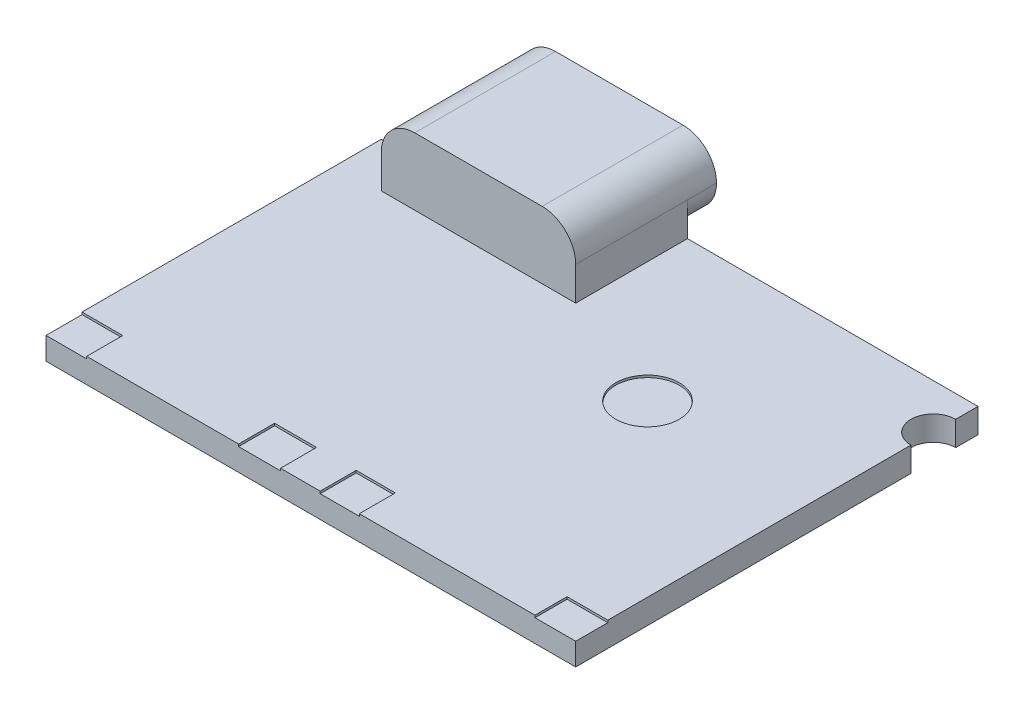
ISO-10303-21;
HEADER;
FILE_DESCRIPTION(('STEP AP214'),'2;1');
FILE_NAME('part.step','',(''),(''),'','','');
FILE_SCHEMA(('AUTOMOTIVE_DESIGN { 1 0 10303 214 1 1 1 1 }'));
ENDSEC;
DATA;
#1=APPLICATION_CONTEXT('core data for automotive mechanical design processes');
#2=APPLICATION_PROTOCOL_DEFINITION('international standard','automotive_design',2000,#1);
#3=PRODUCT_CONTEXT('',#1,'mechanical');
#4=PRODUCT('Part','Part','',(#3));
#5=PRODUCT_RELATED_PRODUCT_CATEGORY('part','',(#4));
#6=PRODUCT_DEFINITION_FORMATION('','',#4);
#7=PRODUCT_DEFINITION_CONTEXT('part definition',#1,'design');
#8=PRODUCT_DEFINITION('design','',#6,#7);
#9=PRODUCT_DEFINITION_SHAPE('','',#8);
#10=(LENGTH_UNIT() NAMED_UNIT(*) SI_UNIT(.MILLI.,.METRE.));
#11=(NAMED_UNIT(*) PLANE_ANGLE_UNIT() SI_UNIT($,.RADIAN.));
#12=(NAMED_UNIT(*) SI_UNIT($,.STERADIAN.) SOLID_ANGLE_UNIT());
#13=UNCERTAINTY_MEASURE_WITH_UNIT(LENGTH_MEASURE(1.E-05),#10,'distance_accuracy_value','');
#14=(GEOMETRIC_REPRESENTATION_CONTEXT(3) GLOBAL_UNCERTAINTY_ASSIGNED_CONTEXT((#13)) GLOBAL_UNIT_ASSIGNED_CONTEXT((#10,
#11,#12)) REPRESENTATION_CONTEXT('',''));
#15=CARTESIAN_POINT('',(0.,0.,0.));
#16=DIRECTION('',(0.,0.,1.));
#17=DIRECTION('',(1.,0.,0.));
#18=AXIS2_PLACEMENT_3D('',#15,#16,#17);
#19=CARTESIAN_POINT('',(0.,1.1,0.));
#20=DIRECTION('',(1.,0.,0.));
#21=DIRECTION('',(0.,0.,-1.));
#22=AXIS2_PLACEMENT_3D('',#19,#20,#21);
#23=PLANE('',#22);
#24=DIRECTION('',(0.,0.,1.));
#25=VECTOR('',#24,1.);
#26=CARTESIAN_POINT('',(0.,0.,0.));
#27=LINE('',#26,#25);
#28=CARTESIAN_POINT('',(0.,0.,-18.));
#29=VERTEX_POINT('',#28);
#30=CARTESIAN_POINT('',(0.,0.,-17.));
#31=VERTEX_POINT('',#30);
#32=EDGE_CURVE('E266',#29,#31,#27,.T.);
#33=ORIENTED_EDGE('',*,*,#32,.T.);
#34=DIRECTION('',(0.,1.,0.));
#35=VECTOR('',#34,1.);
#36=CARTESIAN_POINT('',(0.,0.,-17.));
#37=LINE('',#36,#35);
#38=CARTESIAN_POINT('',(0.,1.1,-17.));
#39=VERTEX_POINT('',#38);
#40=EDGE_CURVE('E64',#31,#39,#37,.T.);
#41=ORIENTED_EDGE('',*,*,#40,.T.);
#42=DIRECTION('',(0.,0.,1.));
#43=VECTOR('',#42,1.);
#44=CARTESIAN_POINT('',(0.,1.1,0.));
#45=LINE('',#44,#43);
#46=CARTESIAN_POINT('',(0.,1.1,-18.));
#47=VERTEX_POINT('',#46);
#48=EDGE_CURVE('E463',#47,#39,#45,.T.);
#49=ORIENTED_EDGE('',*,*,#48,.F.);
#50=DIRECTION('',(0.,-1.,0.));
#51=VECTOR('',#50,1.);
#52=CARTESIAN_POINT('',(0.,1.1,-18.));
#53=LINE('',#52,#51);
#54=EDGE_CURVE('E272',#47,#29,#53,.T.);
#55=ORIENTED_EDGE('',*,*,#54,.T.);
#56=EDGE_LOOP('',(#33,#41,#49,#55));
#57=FACE_BOUND('',#56,.T.);
#58=ADVANCED_FACE('F42',(#57),#23,.F.);
#59=CARTESIAN_POINT('',(23.7,1.1,0.));
#60=DIRECTION('',(-1.,0.,0.));
#61=DIRECTION('',(0.,0.,1.));
#62=AXIS2_PLACEMENT_3D('',#59,#60,#61);
#63=PLANE('',#62);
#64=DIRECTION('',(0.,0.,-1.));
#65=VECTOR('',#64,1.);
#66=CARTESIAN_POINT('',(23.7,0.,0.));
#67=LINE('',#66,#65);
#68=CARTESIAN_POINT('',(23.7,0.,0.));
#69=VERTEX_POINT('',#68);
#70=CARTESIAN_POINT('',(23.7,0.,-15.));
#71=VERTEX_POINT('',#70);
#72=EDGE_CURVE('E262',#69,#71,#67,.T.);
#73=ORIENTED_EDGE('',*,*,#72,.T.);
#74=DIRECTION('',(0.,1.,0.));
#75=VECTOR('',#74,1.);
#76=CARTESIAN_POINT('',(23.7,0.,-15.));
#77=LINE('',#76,#75);
#78=CARTESIAN_POINT('',(23.7,1.1,-15.));
#79=VERTEX_POINT('',#78);
#80=EDGE_CURVE('E56',#71,#79,#77,.T.);
#81=ORIENTED_EDGE('',*,*,#80,.T.);
#82=DIRECTION('',(0.,0.,-1.));
#83=VECTOR('',#82,1.);
#84=CARTESIAN_POINT('',(23.7,1.1,0.));
#85=LINE('',#84,#83);
#86=CARTESIAN_POINT('',(23.7,1.1,-1.43434090909091));
#87=VERTEX_POINT('',#86);
#88=EDGE_CURVE('E471',#87,#79,#85,.T.);
#89=ORIENTED_EDGE('',*,*,#88,.F.);
#90=DIRECTION('',(0.,1.,0.));
#91=VECTOR('',#90,1.);
#92=CARTESIAN_POINT('',(23.7,1.,-1.43434090909091));
#93=LINE('',#92,#91);
#94=CARTESIAN_POINT('',(23.7,1.,-1.43434090909091));
#95=VERTEX_POINT('',#94);
#96=EDGE_CURVE('E425',#95,#87,#93,.T.);
#97=ORIENTED_EDGE('',*,*,#96,.F.);
#98=DIRECTION('',(0.,0.,-1.));
#99=VECTOR('',#98,1.);
#100=CARTESIAN_POINT('',(23.7,1.,0.));
#101=LINE('',#100,#99);
#102=CARTESIAN_POINT('',(23.7,1.,0.));
#103=VERTEX_POINT('',#102);
#104=EDGE_CURVE('E421',#103,#95,#101,.T.);
#105=ORIENTED_EDGE('',*,*,#104,.F.);
#106=DIRECTION('',(0.,-1.,0.));
#107=VECTOR('',#106,1.);
#108=CARTESIAN_POINT('',(23.7,1.1,0.));
#109=LINE('',#108,#107);
#110=EDGE_CURVE('E278',#103,#69,#109,.T.);
#111=ORIENTED_EDGE('',*,*,#110,.T.);
#112=EDGE_LOOP('',(#73,#81,#89,#97,#105,#111));
#113=FACE_BOUND('',#112,.T.);
#114=ADVANCED_FACE('F494',(#113),#63,.F.);
#115=CARTESIAN_POINT('',(0.,1.1,0.));
#116=DIRECTION('',(0.,-1.,0.));
#117=DIRECTION('',(0.,0.,-1.));
#118=AXIS2_PLACEMENT_3D('',#115,#116,#117);
#119=PLANE('',#118);
#120=CARTESIAN_POINT('',(16.09729289422,1.1,-10.8164207351291));
#121=DIRECTION('',(0.,1.,0.));
#122=DIRECTION('',(0.,0.,1.));
#123=AXIS2_PLACEMENT_3D('',#120,#121,#122);
#124=CIRCLE('',#123,1.42021684365162);
#125=CARTESIAN_POINT('',(16.09729289422,1.1,-9.39620389147745));
#126=VERTEX_POINT('',#125);
#127=EDGE_CURVE('E329',#126,#126,#124,.T.);
#128=ORIENTED_EDGE('',*,*,#127,.F.);
#129=EDGE_LOOP('',(#128));
#130=FACE_BOUND('',#129,.T.);
#131=ORIENTED_EDGE('',*,*,#48,.T.);
#132=CARTESIAN_POINT('',(0.,1.1,-16.));
#133=DIRECTION('',(0.,1.,0.));
#134=DIRECTION('',(0.,0.,1.));
#135=AXIS2_PLACEMENT_3D('',#132,#133,#134);
#136=CIRCLE('',#135,1.);
#137=CARTESIAN_POINT('',(0.,1.1,-15.));
#138=VERTEX_POINT('',#137);
#139=EDGE_CURVE('E567',#138,#39,#136,.T.);
#140=ORIENTED_EDGE('',*,*,#139,.F.);
#141=CARTESIAN_POINT('',(0.,1.1,-1.61183971661055));
#142=VERTEX_POINT('',#141);
#143=EDGE_CURVE('E271',#138,#142,#45,.T.);
#144=ORIENTED_EDGE('',*,*,#143,.T.);
#145=DIRECTION('',(1.,0.,0.));
#146=VECTOR('',#145,1.);
#147=CARTESIAN_POINT('',(0.,1.1,-1.61183971661055));
#148=LINE('',#147,#146);
#149=CARTESIAN_POINT('',(1.82131737514029,1.1,-1.61183971661055));
#150=VERTEX_POINT('',#149);
#151=EDGE_CURVE('E334',#142,#150,#148,.T.);
#152=ORIENTED_EDGE('',*,*,#151,.T.);
#153=DIRECTION('',(0.,0.,-1.));
#154=VECTOR('',#153,1.);
#155=CARTESIAN_POINT('',(1.82131737514029,1.1,0.));
#156=LINE('',#155,#154);
#157=CARTESIAN_POINT('',(1.82131737514029,1.1,0.));
#158=VERTEX_POINT('',#157);
#159=EDGE_CURVE('E348',#158,#150,#156,.T.);
#160=ORIENTED_EDGE('',*,*,#159,.F.);
#161=DIRECTION('',(1.,0.,0.));
#162=VECTOR('',#161,1.);
#163=CARTESIAN_POINT('',(0.,1.1,0.));
#164=LINE('',#163,#162);
#165=CARTESIAN_POINT('',(8.61698600589226,1.1,0.));
#166=VERTEX_POINT('',#165);
#167=EDGE_CURVE('E470',#158,#166,#164,.T.);
#168=ORIENTED_EDGE('',*,*,#167,.T.);
#169=DIRECTION('',(0.,0.,-1.));
#170=VECTOR('',#169,1.);
#171=CARTESIAN_POINT('',(8.61698600589226,1.1,0.));
#172=LINE('',#171,#170);
#173=CARTESIAN_POINT('',(8.61698600589226,1.1,-1.61183971661055));
#174=VERTEX_POINT('',#173);
#175=EDGE_CURVE('E374',#166,#174,#172,.T.);
#176=ORIENTED_EDGE('',*,*,#175,.T.);
#177=DIRECTION('',(1.,0.,0.));
#178=VECTOR('',#177,1.);
#179=CARTESIAN_POINT('',(8.61698600589226,1.1,-1.61183971661055));
#180=LINE('',#179,#178);
#181=CARTESIAN_POINT('',(10.4934019710999,1.1,-1.61183971661055));
#182=VERTEX_POINT('',#181);
#183=EDGE_CURVE('E342',#174,#182,#180,.T.);
#184=ORIENTED_EDGE('',*,*,#183,.T.);
#185=DIRECTION('',(0.,0.,-1.));
#186=VECTOR('',#185,1.);
#187=CARTESIAN_POINT('',(10.4934019710999,1.1,0.));
#188=LINE('',#187,#186);
#189=CARTESIAN_POINT('',(10.4934019710999,1.1,0.));
#190=VERTEX_POINT('',#189);
#191=EDGE_CURVE('E377',#190,#182,#188,.T.);
#192=ORIENTED_EDGE('',*,*,#191,.F.);
#193=CARTESIAN_POINT('',(12.2683900462963,1.1,0.));
#194=VERTEX_POINT('',#193);
#195=EDGE_CURVE('E469',#190,#194,#164,.T.);
#196=ORIENTED_EDGE('',*,*,#195,.T.);
#197=DIRECTION('',(0.,0.,-1.));
#198=VECTOR('',#197,1.);
#199=CARTESIAN_POINT('',(12.2683900462963,1.1,0.));
#200=LINE('',#199,#198);
#201=CARTESIAN_POINT('',(12.2683900462963,1.1,-1.61183971661055));
#202=VERTEX_POINT('',#201);
#203=EDGE_CURVE('E402',#194,#202,#200,.T.);
#204=ORIENTED_EDGE('',*,*,#203,.T.);
#205=DIRECTION('',(1.,0.,0.));
#206=VECTOR('',#205,1.);
#207=CARTESIAN_POINT('',(12.2683900462963,1.1,-1.61183971661055));
#208=LINE('',#207,#206);
#209=CARTESIAN_POINT('',(14.0180211489899,1.1,-1.61183971661055));
#210=VERTEX_POINT('',#209);
#211=EDGE_CURVE('E366',#202,#210,#208,.T.);
#212=ORIENTED_EDGE('',*,*,#211,.T.);
#213=DIRECTION('',(0.,0.,-1.));
#214=VECTOR('',#213,1.);
#215=CARTESIAN_POINT('',(14.0180211489899,1.1,0.));
#216=LINE('',#215,#214);
#217=CARTESIAN_POINT('',(14.0180211489899,1.1,0.));
#218=VERTEX_POINT('',#217);
#219=EDGE_CURVE('E405',#218,#210,#216,.T.);
#220=ORIENTED_EDGE('',*,*,#219,.F.);
#221=CARTESIAN_POINT('',(21.8786826248597,1.1,0.));
#222=VERTEX_POINT('',#221);
#223=EDGE_CURVE('E466',#218,#222,#164,.T.);
#224=ORIENTED_EDGE('',*,*,#223,.T.);
#225=DIRECTION('',(0.,0.,-1.));
#226=VECTOR('',#225,1.);
#227=CARTESIAN_POINT('',(21.8786826248597,1.1,0.));
#228=LINE('',#227,#226);
#229=CARTESIAN_POINT('',(21.8786826248597,1.1,-1.43434090909091));
#230=VERTEX_POINT('',#229);
#231=EDGE_CURVE('E427',#222,#230,#228,.T.);
#232=ORIENTED_EDGE('',*,*,#231,.T.);
#233=DIRECTION('',(-1.,0.,0.));
#234=VECTOR('',#233,1.);
#235=CARTESIAN_POINT('',(23.7,1.1,-1.43434090909091));
#236=LINE('',#235,#234);
#237=EDGE_CURVE('E394',#87,#230,#236,.T.);
#238=ORIENTED_EDGE('',*,*,#237,.F.);
#239=ORIENTED_EDGE('',*,*,#88,.T.);
#240=CARTESIAN_POINT('',(23.7,1.1,-16.));
#241=DIRECTION('',(0.,1.,0.));
#242=DIRECTION('',(0.,0.,1.));
#243=AXIS2_PLACEMENT_3D('',#240,#241,#242);
#244=CIRCLE('',#243,1.);
#245=CARTESIAN_POINT('',(23.7,1.1,-17.));
#246=VERTEX_POINT('',#245);
#247=EDGE_CURVE('E531',#246,#79,#244,.T.);
#248=ORIENTED_EDGE('',*,*,#247,.F.);
#249=CARTESIAN_POINT('',(23.7,1.1,-18.));
#250=VERTEX_POINT('',#249);
#251=EDGE_CURVE('E255',#246,#250,#85,.T.);
#252=ORIENTED_EDGE('',*,*,#251,.T.);
#253=DIRECTION('',(-1.,0.,0.));
#254=VECTOR('',#253,1.);
#255=CARTESIAN_POINT('',(0.,1.1,-18.));
#256=LINE('',#255,#254);
#257=CARTESIAN_POINT('',(10.7,1.1,-18.));
#258=VERTEX_POINT('',#257);
#259=EDGE_CURVE('E276',#250,#258,#256,.T.);
#260=ORIENTED_EDGE('',*,*,#259,.T.);
#261=DIRECTION('',(0.,0.,-1.));
#262=VECTOR('',#261,1.);
#263=CARTESIAN_POINT('',(10.7,1.1,-19.3));
#264=LINE('',#263,#262);
#265=CARTESIAN_POINT('',(10.7,1.1,-13.));
#266=VERTEX_POINT('',#265);
#267=EDGE_CURVE('E454',#266,#258,#264,.T.);
#268=ORIENTED_EDGE('',*,*,#267,.F.);
#269=DIRECTION('',(1.,0.,0.));
#270=VECTOR('',#269,1.);
#271=CARTESIAN_POINT('',(2.,1.1,-13.));
#272=LINE('',#271,#270);
#273=CARTESIAN_POINT('',(2.,1.1,-13.));
#274=VERTEX_POINT('',#273);
#275=EDGE_CURVE('E321',#274,#266,#272,.T.);
#276=ORIENTED_EDGE('',*,*,#275,.F.);
#277=DIRECTION('',(0.,0.,1.));
#278=VECTOR('',#277,1.);
#279=CARTESIAN_POINT('',(1.99999999999999,1.1,-19.3));
#280=LINE('',#279,#278);
#281=CARTESIAN_POINT('',(1.99999999999999,1.1,-18.));
#282=VERTEX_POINT('',#281);
#283=EDGE_CURVE('E283',#282,#274,#280,.T.);
#284=ORIENTED_EDGE('',*,*,#283,.F.);
#285=EDGE_CURVE('E474',#282,#47,#256,.T.);
#286=ORIENTED_EDGE('',*,*,#285,.T.);
#287=EDGE_LOOP('',(#131,#140,#144,#152,#160,#168,#176,#184,#192,#196,#204,#212,#220,#224,#232,
#238,#239,#248,#252,#260,#268,#276,#284,#286));
#288=FACE_BOUND('',#287,.T.);
#289=ADVANCED_FACE('F509',(#130,#288),#119,.F.);
#290=ORIENTED_EDGE('',*,*,#143,.F.);
#291=DIRECTION('',(0.,1.,0.));
#292=VECTOR('',#291,1.);
#293=CARTESIAN_POINT('',(0.,0.,-15.));
#294=LINE('',#293,#292);
#295=CARTESIAN_POINT('',(0.,0.,-15.));
#296=VERTEX_POINT('',#295);
#297=EDGE_CURVE('E485',#138,#296,#294,.F.);
#298=ORIENTED_EDGE('',*,*,#297,.T.);
#299=CARTESIAN_POINT('',(0.,0.,0.));
#300=VERTEX_POINT('',#299);
#301=EDGE_CURVE('E462',#296,#300,#27,.T.);
#302=ORIENTED_EDGE('',*,*,#301,.T.);
#303=DIRECTION('',(0.,-1.,0.));
#304=VECTOR('',#303,1.);
#305=CARTESIAN_POINT('',(0.,1.1,0.));
#306=LINE('',#305,#304);
#307=CARTESIAN_POINT('',(0.,1.,0.));
#308=VERTEX_POINT('',#307);
#309=EDGE_CURVE('E280',#308,#300,#306,.T.);
#310=ORIENTED_EDGE('',*,*,#309,.F.);
#311=DIRECTION('',(0.,0.,-1.));
#312=VECTOR('',#311,1.);
#313=CARTESIAN_POINT('',(0.,1.,0.));
#314=LINE('',#313,#312);
#315=CARTESIAN_POINT('',(0.,1.,-1.61183971661055));
#316=VERTEX_POINT('',#315);
#317=EDGE_CURVE('E347',#308,#316,#314,.T.);
#318=ORIENTED_EDGE('',*,*,#317,.T.);
#319=DIRECTION('',(0.,1.,0.));
#320=VECTOR('',#319,1.);
#321=CARTESIAN_POINT('',(0.,1.,-1.61183971661055));
#322=LINE('',#321,#320);
#323=EDGE_CURVE('E344',#316,#142,#322,.T.);
#324=ORIENTED_EDGE('',*,*,#323,.T.);
#325=EDGE_LOOP('',(#290,#298,#302,#310,#318,#324));
#326=FACE_BOUND('',#325,.T.);
#327=ADVANCED_FACE('F484',(#326),#23,.F.);
#328=CARTESIAN_POINT('',(0.,1.1,0.));
#329=DIRECTION('',(0.,0.,-1.));
#330=DIRECTION('',(-1.,0.,0.));
#331=AXIS2_PLACEMENT_3D('',#328,#329,#330);
#332=PLANE('',#331);
#333=ORIENTED_EDGE('',*,*,#167,.F.);
#334=DIRECTION('',(0.,1.,0.));
#335=VECTOR('',#334,1.);
#336=CARTESIAN_POINT('',(1.82131737514029,1.,0.));
#337=LINE('',#336,#335);
#338=CARTESIAN_POINT('',(1.82131737514029,1.,0.));
#339=VERTEX_POINT('',#338);
#340=EDGE_CURVE('E341',#339,#158,#337,.T.);
#341=ORIENTED_EDGE('',*,*,#340,.F.);
#342=DIRECTION('',(1.,0.,0.));
#343=VECTOR('',#342,1.);
#344=CARTESIAN_POINT('',(0.,1.,0.));
#345=LINE('',#344,#343);
#346=EDGE_CURVE('E356',#308,#339,#345,.T.);
#347=ORIENTED_EDGE('',*,*,#346,.F.);
#348=ORIENTED_EDGE('',*,*,#309,.T.);
#349=DIRECTION('',(1.,0.,0.));
#350=VECTOR('',#349,1.);
#351=CARTESIAN_POINT('',(0.,0.,0.));
#352=LINE('',#351,#350);
#353=EDGE_CURVE('E263',#300,#69,#352,.T.);
#354=ORIENTED_EDGE('',*,*,#353,.T.);
#355=ORIENTED_EDGE('',*,*,#110,.F.);
#356=DIRECTION('',(-1.,0.,0.));
#357=VECTOR('',#356,1.);
#358=CARTESIAN_POINT('',(23.7,1.,0.));
#359=LINE('',#358,#357);
#360=CARTESIAN_POINT('',(21.8786826248597,1.,0.));
#361=VERTEX_POINT('',#360);
#362=EDGE_CURVE('E435',#103,#361,#359,.T.);
#363=ORIENTED_EDGE('',*,*,#362,.T.);
#364=DIRECTION('',(0.,1.,0.));
#365=VECTOR('',#364,1.);
#366=CARTESIAN_POINT('',(21.8786826248597,1.,0.));
#367=LINE('',#366,#365);
#368=EDGE_CURVE('E422',#361,#222,#367,.T.);
#369=ORIENTED_EDGE('',*,*,#368,.T.);
#370=ORIENTED_EDGE('',*,*,#223,.F.);
#371=DIRECTION('',(0.,1.,0.));
#372=VECTOR('',#371,1.);
#373=CARTESIAN_POINT('',(14.0180211489899,1.,0.));
#374=LINE('',#373,#372);
#375=CARTESIAN_POINT('',(14.0180211489899,1.,0.));
#376=VERTEX_POINT('',#375);
#377=EDGE_CURVE('E393',#376,#218,#374,.T.);
#378=ORIENTED_EDGE('',*,*,#377,.F.);
#379=DIRECTION('',(1.,0.,0.));
#380=VECTOR('',#379,1.);
#381=CARTESIAN_POINT('',(12.2683900462963,1.,0.));
#382=LINE('',#381,#380);
#383=CARTESIAN_POINT('',(12.2683900462963,1.,0.));
#384=VERTEX_POINT('',#383);
#385=EDGE_CURVE('E412',#384,#376,#382,.T.);
#386=ORIENTED_EDGE('',*,*,#385,.F.);
#387=DIRECTION('',(0.,1.,0.));
#388=VECTOR('',#387,1.);
#389=CARTESIAN_POINT('',(12.2683900462963,1.,0.));
#390=LINE('',#389,#388);
#391=EDGE_CURVE('E396',#384,#194,#390,.T.);
#392=ORIENTED_EDGE('',*,*,#391,.T.);
#393=ORIENTED_EDGE('',*,*,#195,.F.);
#394=DIRECTION('',(0.,1.,0.));
#395=VECTOR('',#394,1.);
#396=CARTESIAN_POINT('',(10.4934019710999,1.,0.));
#397=LINE('',#396,#395);
#398=CARTESIAN_POINT('',(10.4934019710999,1.,0.));
#399=VERTEX_POINT('',#398);
#400=EDGE_CURVE('E365',#399,#190,#397,.T.);
#401=ORIENTED_EDGE('',*,*,#400,.F.);
#402=DIRECTION('',(1.,0.,0.));
#403=VECTOR('',#402,1.);
#404=CARTESIAN_POINT('',(8.61698600589226,1.,0.));
#405=LINE('',#404,#403);
#406=CARTESIAN_POINT('',(8.61698600589226,1.,0.));
#407=VERTEX_POINT('',#406);
#408=EDGE_CURVE('E384',#407,#399,#405,.T.);
#409=ORIENTED_EDGE('',*,*,#408,.F.);
#410=DIRECTION('',(0.,1.,0.));
#411=VECTOR('',#410,1.);
#412=CARTESIAN_POINT('',(8.61698600589226,1.,0.));
#413=LINE('',#412,#411);
#414=EDGE_CURVE('E368',#407,#166,#413,.T.);
#415=ORIENTED_EDGE('',*,*,#414,.T.);
#416=EDGE_LOOP('',(#333,#341,#347,#348,#354,#355,#363,#369,#370,#378,#386,#392,#393,#401,#409,#415));
#417=FACE_BOUND('',#416,.T.);
#418=ADVANCED_FACE('F490',(#417),#332,.F.);
#419=ORIENTED_EDGE('',*,*,#251,.F.);
#420=DIRECTION('',(0.,1.,0.));
#421=VECTOR('',#420,1.);
#422=CARTESIAN_POINT('',(23.7,0.,-17.));
#423=LINE('',#422,#421);
#424=CARTESIAN_POINT('',(23.7,0.,-17.));
#425=VERTEX_POINT('',#424);
#426=EDGE_CURVE('E243',#246,#425,#423,.F.);
#427=ORIENTED_EDGE('',*,*,#426,.T.);
#428=CARTESIAN_POINT('',(23.7,0.,-18.));
#429=VERTEX_POINT('',#428);
#430=EDGE_CURVE('E253',#425,#429,#67,.T.);
#431=ORIENTED_EDGE('',*,*,#430,.T.);
#432=DIRECTION('',(0.,-1.,0.));
#433=VECTOR('',#432,1.);
#434=CARTESIAN_POINT('',(23.7,1.1,-18.));
#435=LINE('',#434,#433);
#436=EDGE_CURVE('E275',#250,#429,#435,.T.);
#437=ORIENTED_EDGE('',*,*,#436,.F.);
#438=EDGE_LOOP('',(#419,#427,#431,#437));
#439=FACE_BOUND('',#438,.T.);
#440=ADVANCED_FACE('F251',(#439),#63,.F.);
#441=CARTESIAN_POINT('',(0.,1.1,-18.));
#442=DIRECTION('',(0.,0.,1.));
#443=DIRECTION('',(1.,0.,0.));
#444=AXIS2_PLACEMENT_3D('',#441,#442,#443);
#445=PLANE('',#444);
#446=DIRECTION('',(-1.,0.,0.));
#447=VECTOR('',#446,1.);
#448=CARTESIAN_POINT('',(0.,0.,-18.));
#449=LINE('',#448,#447);
#450=EDGE_CURVE('E261',#429,#29,#449,.T.);
#451=ORIENTED_EDGE('',*,*,#450,.T.);
#452=ORIENTED_EDGE('',*,*,#54,.F.);
#453=ORIENTED_EDGE('',*,*,#285,.F.);
#454=DIRECTION('',(0.,-1.,0.));
#455=VECTOR('',#454,1.);
#456=CARTESIAN_POINT('',(1.99999999999999,4.1,-18.));
#457=LINE('',#456,#455);
#458=CARTESIAN_POINT('',(1.99999999999999,2.6,-18.));
#459=VERTEX_POINT('',#458);
#460=EDGE_CURVE('E306',#459,#282,#457,.T.);
#461=ORIENTED_EDGE('',*,*,#460,.F.);
#462=CARTESIAN_POINT('',(3.49999999999999,2.6,-18.));
#463=DIRECTION('',(0.,0.,1.));
#464=DIRECTION('',(1.,0.,0.));
#465=AXIS2_PLACEMENT_3D('',#462,#463,#464);
#466=CIRCLE('',#465,1.5);
#467=CARTESIAN_POINT('',(3.49999999999999,1.1,-18.));
#468=VERTEX_POINT('',#467);
#469=EDGE_CURVE('E50',#459,#468,#466,.T.);
#470=ORIENTED_EDGE('',*,*,#469,.T.);
#471=CARTESIAN_POINT('',(9.19999999999999,1.1,-18.));
#472=VERTEX_POINT('',#471);
#473=EDGE_CURVE('E476',#472,#468,#256,.T.);
#474=ORIENTED_EDGE('',*,*,#473,.F.);
#475=CARTESIAN_POINT('',(9.19999999999999,2.6,-18.));
#476=DIRECTION('',(0.,0.,1.));
#477=DIRECTION('',(1.,0.,0.));
#478=AXIS2_PLACEMENT_3D('',#475,#476,#477);
#479=CIRCLE('',#478,1.5);
#480=CARTESIAN_POINT('',(10.7,2.6,-18.));
#481=VERTEX_POINT('',#480);
#482=EDGE_CURVE('E316',#472,#481,#479,.T.);
#483=ORIENTED_EDGE('',*,*,#482,.T.);
#484=DIRECTION('',(0.,1.,0.));
#485=VECTOR('',#484,1.);
#486=CARTESIAN_POINT('',(10.7,4.1,-18.));
#487=LINE('',#486,#485);
#488=EDGE_CURVE('E300',#258,#481,#487,.T.);
#489=ORIENTED_EDGE('',*,*,#488,.F.);
#490=ORIENTED_EDGE('',*,*,#259,.F.);
#491=ORIENTED_EDGE('',*,*,#436,.T.);
#492=EDGE_LOOP('',(#451,#452,#453,#461,#470,#474,#483,#489,#490,#491));
#493=FACE_BOUND('',#492,.T.);
#494=ADVANCED_FACE('F533',(#493),#445,.F.);
#495=CARTESIAN_POINT('',(0.,0.,0.));
#496=DIRECTION('',(0.,-1.,0.));
#497=DIRECTION('',(0.,0.,-1.));
#498=AXIS2_PLACEMENT_3D('',#495,#496,#497);
#499=PLANE('',#498);
#500=CARTESIAN_POINT('',(0.,0.,-16.));
#501=DIRECTION('',(0.,1.,0.));
#502=DIRECTION('',(0.,0.,1.));
#503=AXIS2_PLACEMENT_3D('',#500,#501,#502);
#504=CIRCLE('',#503,1.);
#505=EDGE_CURVE('E256',#296,#31,#504,.T.);
#506=ORIENTED_EDGE('',*,*,#505,.T.);
#507=ORIENTED_EDGE('',*,*,#32,.F.);
#508=ORIENTED_EDGE('',*,*,#450,.F.);
#509=ORIENTED_EDGE('',*,*,#430,.F.);
#510=CARTESIAN_POINT('',(23.7,0.,-16.));
#511=DIRECTION('',(0.,-1.,0.));
#512=DIRECTION('',(0.,0.,-1.));
#513=AXIS2_PLACEMENT_3D('',#510,#511,#512);
#514=CIRCLE('',#513,1.);
#515=EDGE_CURVE('E11',#71,#425,#514,.T.);
#516=ORIENTED_EDGE('',*,*,#515,.F.);
#517=ORIENTED_EDGE('',*,*,#72,.F.);
#518=ORIENTED_EDGE('',*,*,#353,.F.);
#519=ORIENTED_EDGE('',*,*,#301,.F.);
#520=EDGE_LOOP('',(#506,#507,#508,#509,#516,#517,#518,#519));
#521=FACE_BOUND('',#520,.T.);
#522=ADVANCED_FACE('F259',(#521),#499,.T.);
#523=CARTESIAN_POINT('',(0.,1.1,0.));
#524=DIRECTION('',(0.,1.,0.));
#525=DIRECTION('',(0.,0.,1.));
#526=AXIS2_PLACEMENT_3D('',#523,#524,#525);
#527=PLANE('',#526);
#528=DIRECTION('',(-1.,0.,0.));
#529=VECTOR('',#528,1.);
#530=CARTESIAN_POINT('',(1.99999999999999,1.1,-19.3));
#531=LINE('',#530,#529);
#532=CARTESIAN_POINT('',(9.19999999999999,1.1,-19.3));
#533=VERTEX_POINT('',#532);
#534=CARTESIAN_POINT('',(3.49999999999999,1.1,-19.3));
#535=VERTEX_POINT('',#534);
#536=EDGE_CURVE('E446',#533,#535,#531,.T.);
#537=ORIENTED_EDGE('',*,*,#536,.F.);
#538=DIRECTION('',(0.,0.,-1.));
#539=VECTOR('',#538,1.);
#540=CARTESIAN_POINT('',(9.19999999999999,1.1,0.));
#541=LINE('',#540,#539);
#542=EDGE_CURVE('E295',#533,#472,#541,.F.);
#543=ORIENTED_EDGE('',*,*,#542,.T.);
#544=ORIENTED_EDGE('',*,*,#473,.T.);
#545=DIRECTION('',(0.,0.,1.));
#546=VECTOR('',#545,1.);
#547=CARTESIAN_POINT('',(3.5,1.1,0.));
#548=LINE('',#547,#546);
#549=EDGE_CURVE('E292',#468,#535,#548,.F.);
#550=ORIENTED_EDGE('',*,*,#549,.T.);
#551=EDGE_LOOP('',(#537,#543,#544,#550));
#552=FACE_BOUND('',#551,.T.);
#553=ADVANCED_FACE('F559',(#552),#527,.F.);
#554=CARTESIAN_POINT('',(1.99999999999999,4.1,-19.3));
#555=DIRECTION('',(1.,0.,0.));
#556=DIRECTION('',(0.,0.,-1.));
#557=AXIS2_PLACEMENT_3D('',#554,#555,#556);
#558=PLANE('',#557);
#559=DIRECTION('',(0.,0.,1.));
#560=VECTOR('',#559,1.);
#561=CARTESIAN_POINT('',(1.99999999999999,2.6,-19.3));
#562=LINE('',#561,#560);
#563=CARTESIAN_POINT('',(2.,2.6,-13.));
#564=VERTEX_POINT('',#563);
#565=EDGE_CURVE('E303',#564,#459,#562,.F.);
#566=ORIENTED_EDGE('',*,*,#565,.T.);
#567=ORIENTED_EDGE('',*,*,#460,.T.);
#568=ORIENTED_EDGE('',*,*,#283,.T.);
#569=DIRECTION('',(0.,-1.,0.));
#570=VECTOR('',#569,1.);
#571=CARTESIAN_POINT('',(2.,4.1,-13.));
#572=LINE('',#571,#570);
#573=EDGE_CURVE('E460',#564,#274,#572,.T.);
#574=ORIENTED_EDGE('',*,*,#573,.F.);
#575=EDGE_LOOP('',(#566,#567,#568,#574));
#576=FACE_BOUND('',#575,.T.);
#577=ADVANCED_FACE('F549',(#576),#558,.F.);
#578=CARTESIAN_POINT('',(2.,4.1,-13.));
#579=DIRECTION('',(0.,0.,-1.));
#580=DIRECTION('',(-1.,0.,0.));
#581=AXIS2_PLACEMENT_3D('',#578,#579,#580);
#582=PLANE('',#581);
#583=DIRECTION('',(0.,-1.,0.));
#584=VECTOR('',#583,1.);
#585=CARTESIAN_POINT('',(10.7,4.1,-13.));
#586=LINE('',#585,#584);
#587=CARTESIAN_POINT('',(10.7,2.6,-13.));
#588=VERTEX_POINT('',#587);
#589=EDGE_CURVE('E449',#588,#266,#586,.T.);
#590=ORIENTED_EDGE('',*,*,#589,.F.);
#591=CARTESIAN_POINT('',(9.19999999999999,2.6,-13.));
#592=DIRECTION('',(0.,0.,-1.));
#593=DIRECTION('',(-1.,0.,0.));
#594=AXIS2_PLACEMENT_3D('',#591,#592,#593);
#595=CIRCLE('',#594,1.5);
#596=CARTESIAN_POINT('',(9.19999999999999,4.1,-13.));
#597=VERTEX_POINT('',#596);
#598=EDGE_CURVE('E314',#588,#597,#595,.F.);
#599=ORIENTED_EDGE('',*,*,#598,.T.);
#600=DIRECTION('',(1.,0.,0.));
#601=VECTOR('',#600,1.);
#602=CARTESIAN_POINT('',(2.,4.1,-13.));
#603=LINE('',#602,#601);
#604=CARTESIAN_POINT('',(3.5,4.1,-13.));
#605=VERTEX_POINT('',#604);
#606=EDGE_CURVE('E442',#605,#597,#603,.T.);
#607=ORIENTED_EDGE('',*,*,#606,.F.);
#608=CARTESIAN_POINT('',(3.5,2.6,-13.));
#609=DIRECTION('',(0.,0.,-1.));
#610=DIRECTION('',(-1.,0.,0.));
#611=AXIS2_PLACEMENT_3D('',#608,#609,#610);
#612=CIRCLE('',#611,1.5);
#613=EDGE_CURVE('E312',#605,#564,#612,.F.);
#614=ORIENTED_EDGE('',*,*,#613,.T.);
#615=ORIENTED_EDGE('',*,*,#573,.T.);
#616=ORIENTED_EDGE('',*,*,#275,.T.);
#617=EDGE_LOOP('',(#590,#599,#607,#614,#615,#616));
#618=FACE_BOUND('',#617,.T.);
#619=ADVANCED_FACE('F542',(#618),#582,.F.);
#620=CARTESIAN_POINT('',(10.7,4.1,-19.3));
#621=DIRECTION('',(-1.,0.,0.));
#622=DIRECTION('',(0.,0.,1.));
#623=AXIS2_PLACEMENT_3D('',#620,#621,#622);
#624=PLANE('',#623);
#625=ORIENTED_EDGE('',*,*,#267,.T.);
#626=ORIENTED_EDGE('',*,*,#488,.T.);
#627=DIRECTION('',(0.,0.,-1.));
#628=VECTOR('',#627,1.);
#629=CARTESIAN_POINT('',(10.7,2.6,-13.));
#630=LINE('',#629,#628);
#631=EDGE_CURVE('E298',#481,#588,#630,.F.);
#632=ORIENTED_EDGE('',*,*,#631,.T.);
#633=ORIENTED_EDGE('',*,*,#589,.T.);
#634=EDGE_LOOP('',(#625,#626,#632,#633));
#635=FACE_BOUND('',#634,.T.);
#636=ADVANCED_FACE('F537',(#635),#624,.F.);
#637=CARTESIAN_POINT('',(1.99999999999999,4.1,-19.3));
#638=DIRECTION('',(0.,0.,1.));
#639=DIRECTION('',(1.,0.,0.));
#640=AXIS2_PLACEMENT_3D('',#637,#638,#639);
#641=PLANE('',#640);
#642=CARTESIAN_POINT('',(9.19999999999999,2.6,-19.3));
#643=DIRECTION('',(0.,0.,1.));
#644=DIRECTION('',(1.,0.,0.));
#645=AXIS2_PLACEMENT_3D('',#642,#643,#644);
#646=CIRCLE('',#645,1.5);
#647=CARTESIAN_POINT('',(9.19999999999999,4.1,-19.3));
#648=VERTEX_POINT('',#647);
#649=CARTESIAN_POINT('',(10.7,2.6,-19.3));
#650=VERTEX_POINT('',#649);
#651=EDGE_CURVE('E288',#648,#650,#646,.F.);
#652=ORIENTED_EDGE('',*,*,#651,.T.);
#653=CARTESIAN_POINT('',(9.19999999999999,2.6,-19.3));
#654=DIRECTION('',(0.,0.,1.));
#655=DIRECTION('',(1.,0.,0.));
#656=AXIS2_PLACEMENT_3D('',#653,#654,#655);
#657=CIRCLE('',#656,1.5);
#658=EDGE_CURVE('E290',#650,#533,#657,.F.);
#659=ORIENTED_EDGE('',*,*,#658,.T.);
#660=ORIENTED_EDGE('',*,*,#536,.T.);
#661=CARTESIAN_POINT('',(3.49999999999999,2.6,-19.3));
#662=DIRECTION('',(0.,0.,1.));
#663=DIRECTION('',(1.,0.,0.));
#664=AXIS2_PLACEMENT_3D('',#661,#662,#663);
#665=CIRCLE('',#664,1.5);
#666=CARTESIAN_POINT('',(1.99999999999999,2.6,-19.3));
#667=VERTEX_POINT('',#666);
#668=EDGE_CURVE('E286',#535,#667,#665,.F.);
#669=ORIENTED_EDGE('',*,*,#668,.T.);
#670=CARTESIAN_POINT('',(3.49999999999999,2.6,-19.3));
#671=DIRECTION('',(0.,0.,1.));
#672=DIRECTION('',(1.,0.,0.));
#673=AXIS2_PLACEMENT_3D('',#670,#671,#672);
#674=CIRCLE('',#673,1.5);
#675=CARTESIAN_POINT('',(3.49999999999999,4.1,-19.3));
#676=VERTEX_POINT('',#675);
#677=EDGE_CURVE('E284',#667,#676,#674,.F.);
#678=ORIENTED_EDGE('',*,*,#677,.T.);
#679=DIRECTION('',(-1.,0.,0.));
#680=VECTOR('',#679,1.);
#681=CARTESIAN_POINT('',(1.99999999999999,4.1,-19.3));
#682=LINE('',#681,#680);
#683=EDGE_CURVE('E445',#648,#676,#682,.T.);
#684=ORIENTED_EDGE('',*,*,#683,.F.);
#685=EDGE_LOOP('',(#652,#659,#660,#669,#678,#684));
#686=FACE_BOUND('',#685,.T.);
#687=ADVANCED_FACE('F662',(#686),#641,.F.);
#688=CARTESIAN_POINT('',(0.,4.1,0.));
#689=DIRECTION('',(0.,1.,0.));
#690=DIRECTION('',(0.,0.,1.));
#691=AXIS2_PLACEMENT_3D('',#688,#689,#690);
#692=PLANE('',#691);
#693=ORIENTED_EDGE('',*,*,#606,.T.);
#694=DIRECTION('',(0.,0.,-1.));
#695=VECTOR('',#694,1.);
#696=CARTESIAN_POINT('',(9.19999999999999,4.1,-19.3));
#697=LINE('',#696,#695);
#698=EDGE_CURVE('E310',#597,#648,#697,.T.);
#699=ORIENTED_EDGE('',*,*,#698,.T.);
#700=ORIENTED_EDGE('',*,*,#683,.T.);
#701=DIRECTION('',(0.,0.,1.));
#702=VECTOR('',#701,1.);
#703=CARTESIAN_POINT('',(3.5,4.1,-13.));
#704=LINE('',#703,#702);
#705=EDGE_CURVE('E308',#676,#605,#704,.T.);
#706=ORIENTED_EDGE('',*,*,#705,.T.);
#707=EDGE_LOOP('',(#693,#699,#700,#706));
#708=FACE_BOUND('',#707,.T.);
#709=ADVANCED_FACE('F669',(#708),#692,.T.);
#710=CARTESIAN_POINT('',(9.19999999999999,2.6,0.));
#711=DIRECTION('',(0.,0.,1.));
#712=DIRECTION('',(1.,0.,0.));
#713=AXIS2_PLACEMENT_3D('',#710,#711,#712);
#714=CYLINDRICAL_SURFACE('',#713,1.5);
#715=ORIENTED_EDGE('',*,*,#598,.F.);
#716=ORIENTED_EDGE('',*,*,#631,.F.);
#717=DIRECTION('',(0.,0.,-1.));
#718=VECTOR('',#717,1.);
#719=CARTESIAN_POINT('',(10.7,2.6,-13.));
#720=LINE('',#719,#718);
#721=EDGE_CURVE('E319',#650,#481,#720,.F.);
#722=ORIENTED_EDGE('',*,*,#721,.F.);
#723=ORIENTED_EDGE('',*,*,#651,.F.);
#724=ORIENTED_EDGE('',*,*,#698,.F.);
#725=EDGE_LOOP('',(#715,#716,#722,#723,#724));
#726=FACE_BOUND('',#725,.T.);
#727=ADVANCED_FACE('F677',(#726),#714,.T.);
#728=CARTESIAN_POINT('',(9.19999999999999,2.6,-19.3));
#729=DIRECTION('',(0.,0.,-1.));
#730=DIRECTION('',(-1.,0.,0.));
#731=AXIS2_PLACEMENT_3D('',#728,#729,#730);
#732=CYLINDRICAL_SURFACE('',#731,1.5);
#733=ORIENTED_EDGE('',*,*,#482,.F.);
#734=ORIENTED_EDGE('',*,*,#542,.F.);
#735=ORIENTED_EDGE('',*,*,#658,.F.);
#736=ORIENTED_EDGE('',*,*,#721,.T.);
#737=EDGE_LOOP('',(#733,#734,#735,#736));
#738=FACE_BOUND('',#737,.T.);
#739=ADVANCED_FACE('F685',(#738),#732,.T.);
#740=CARTESIAN_POINT('',(3.5,2.6,0.));
#741=DIRECTION('',(0.,0.,-1.));
#742=DIRECTION('',(-1.,0.,0.));
#743=AXIS2_PLACEMENT_3D('',#740,#741,#742);
#744=CYLINDRICAL_SURFACE('',#743,1.5);
#745=ORIENTED_EDGE('',*,*,#705,.F.);
#746=ORIENTED_EDGE('',*,*,#677,.F.);
#747=DIRECTION('',(0.,0.,1.));
#748=VECTOR('',#747,1.);
#749=CARTESIAN_POINT('',(1.99999999999999,2.6,-19.3));
#750=LINE('',#749,#748);
#751=EDGE_CURVE('E322',#459,#667,#750,.F.);
#752=ORIENTED_EDGE('',*,*,#751,.F.);
#753=ORIENTED_EDGE('',*,*,#565,.F.);
#754=ORIENTED_EDGE('',*,*,#613,.F.);
#755=EDGE_LOOP('',(#745,#746,#752,#753,#754));
#756=FACE_BOUND('',#755,.T.);
#757=ADVANCED_FACE('F44',(#756),#744,.T.);
#758=CARTESIAN_POINT('',(3.49999999999999,2.6,-19.3));
#759=DIRECTION('',(0.,0.,1.));
#760=DIRECTION('',(1.,0.,0.));
#761=AXIS2_PLACEMENT_3D('',#758,#759,#760);
#762=CYLINDRICAL_SURFACE('',#761,1.5);
#763=ORIENTED_EDGE('',*,*,#668,.F.);
#764=ORIENTED_EDGE('',*,*,#549,.F.);
#765=ORIENTED_EDGE('',*,*,#469,.F.);
#766=ORIENTED_EDGE('',*,*,#751,.T.);
#767=EDGE_LOOP('',(#763,#764,#765,#766));
#768=FACE_BOUND('',#767,.T.);
#769=ADVANCED_FACE('F554',(#768),#762,.T.);
#770=CARTESIAN_POINT('',(23.7,1.,-1.43434090909091));
#771=DIRECTION('',(0.,0.,-1.));
#772=DIRECTION('',(-1.,0.,0.));
#773=AXIS2_PLACEMENT_3D('',#770,#771,#772);
#774=PLANE('',#773);
#775=ORIENTED_EDGE('',*,*,#237,.T.);
#776=DIRECTION('',(0.,1.,0.));
#777=VECTOR('',#776,1.);
#778=CARTESIAN_POINT('',(21.8786826248597,1.,-1.43434090909091));
#779=LINE('',#778,#777);
#780=CARTESIAN_POINT('',(21.8786826248597,1.,-1.43434090909091));
#781=VERTEX_POINT('',#780);
#782=EDGE_CURVE('E419',#781,#230,#779,.T.);
#783=ORIENTED_EDGE('',*,*,#782,.F.);
#784=DIRECTION('',(-1.,0.,0.));
#785=VECTOR('',#784,1.);
#786=CARTESIAN_POINT('',(23.7,1.,-1.43434090909091));
#787=LINE('',#786,#785);
#788=EDGE_CURVE('E430',#95,#781,#787,.T.);
#789=ORIENTED_EDGE('',*,*,#788,.F.);
#790=ORIENTED_EDGE('',*,*,#96,.T.);
#791=EDGE_LOOP('',(#775,#783,#789,#790));
#792=FACE_BOUND('',#791,.T.);
#793=ADVANCED_FACE('F506',(#792),#774,.F.);
#794=CARTESIAN_POINT('',(21.8786826248597,1.,0.));
#795=DIRECTION('',(1.,0.,0.));
#796=DIRECTION('',(0.,0.,-1.));
#797=AXIS2_PLACEMENT_3D('',#794,#795,#796);
#798=PLANE('',#797);
#799=ORIENTED_EDGE('',*,*,#231,.F.);
#800=ORIENTED_EDGE('',*,*,#368,.F.);
#801=DIRECTION('',(0.,0.,-1.));
#802=VECTOR('',#801,1.);
#803=CARTESIAN_POINT('',(21.8786826248597,1.,0.));
#804=LINE('',#803,#802);
#805=EDGE_CURVE('E438',#361,#781,#804,.T.);
#806=ORIENTED_EDGE('',*,*,#805,.T.);
#807=ORIENTED_EDGE('',*,*,#782,.T.);
#808=EDGE_LOOP('',(#799,#800,#806,#807));
#809=FACE_BOUND('',#808,.T.);
#810=ADVANCED_FACE('F504',(#809),#798,.T.);
#811=CARTESIAN_POINT('',(0.,1.,0.));
#812=DIRECTION('',(0.,-1.,0.));
#813=DIRECTION('',(0.,0.,-1.));
#814=AXIS2_PLACEMENT_3D('',#811,#812,#813);
#815=PLANE('',#814);
#816=ORIENTED_EDGE('',*,*,#788,.T.);
#817=ORIENTED_EDGE('',*,*,#805,.F.);
#818=ORIENTED_EDGE('',*,*,#362,.F.);
#819=ORIENTED_EDGE('',*,*,#104,.T.);
#820=EDGE_LOOP('',(#816,#817,#818,#819));
#821=FACE_BOUND('',#820,.T.);
#822=ADVANCED_FACE('F501',(#821),#815,.F.);
#823=CARTESIAN_POINT('',(12.2683900462963,1.,-1.61183971661055));
#824=DIRECTION('',(0.,0.,1.));
#825=DIRECTION('',(1.,0.,0.));
#826=AXIS2_PLACEMENT_3D('',#823,#824,#825);
#827=PLANE('',#826);
#828=ORIENTED_EDGE('',*,*,#211,.F.);
#829=DIRECTION('',(0.,1.,0.));
#830=VECTOR('',#829,1.);
#831=CARTESIAN_POINT('',(12.2683900462963,1.,-1.61183971661055));
#832=LINE('',#831,#830);
#833=CARTESIAN_POINT('',(12.2683900462963,1.,-1.61183971661055));
#834=VERTEX_POINT('',#833);
#835=EDGE_CURVE('E399',#834,#202,#832,.T.);
#836=ORIENTED_EDGE('',*,*,#835,.F.);
#837=DIRECTION('',(1.,0.,0.));
#838=VECTOR('',#837,1.);
#839=CARTESIAN_POINT('',(12.2683900462963,1.,-1.61183971661055));
#840=LINE('',#839,#838);
#841=CARTESIAN_POINT('',(14.0180211489899,1.,-1.61183971661055));
#842=VERTEX_POINT('',#841);
#843=EDGE_CURVE('E406',#834,#842,#840,.T.);
#844=ORIENTED_EDGE('',*,*,#843,.T.);
#845=DIRECTION('',(0.,1.,0.));
#846=VECTOR('',#845,1.);
#847=CARTESIAN_POINT('',(14.0180211489899,1.,-1.61183971661055));
#848=LINE('',#847,#846);
#849=EDGE_CURVE('E391',#842,#210,#848,.T.);
#850=ORIENTED_EDGE('',*,*,#849,.T.);
#851=EDGE_LOOP('',(#828,#836,#844,#850));
#852=FACE_BOUND('',#851,.T.);
#853=ADVANCED_FACE('F722',(#852),#827,.T.);
#854=CARTESIAN_POINT('',(14.0180211489899,1.,0.));
#855=DIRECTION('',(1.,0.,0.));
#856=DIRECTION('',(0.,0.,-1.));
#857=AXIS2_PLACEMENT_3D('',#854,#855,#856);
#858=PLANE('',#857);
#859=ORIENTED_EDGE('',*,*,#219,.T.);
#860=ORIENTED_EDGE('',*,*,#849,.F.);
#861=DIRECTION('',(0.,0.,-1.));
#862=VECTOR('',#861,1.);
#863=CARTESIAN_POINT('',(14.0180211489899,1.,0.));
#864=LINE('',#863,#862);
#865=EDGE_CURVE('E415',#376,#842,#864,.T.);
#866=ORIENTED_EDGE('',*,*,#865,.F.);
#867=ORIENTED_EDGE('',*,*,#377,.T.);
#868=EDGE_LOOP('',(#859,#860,#866,#867));
#869=FACE_BOUND('',#868,.T.);
#870=ADVANCED_FACE('F514',(#869),#858,.F.);
#871=CARTESIAN_POINT('',(12.2683900462963,1.,0.));
#872=DIRECTION('',(1.,0.,0.));
#873=DIRECTION('',(0.,0.,-1.));
#874=AXIS2_PLACEMENT_3D('',#871,#872,#873);
#875=PLANE('',#874);
#876=ORIENTED_EDGE('',*,*,#203,.F.);
#877=ORIENTED_EDGE('',*,*,#391,.F.);
#878=DIRECTION('',(0.,0.,-1.));
#879=VECTOR('',#878,1.);
#880=CARTESIAN_POINT('',(12.2683900462963,1.,0.));
#881=LINE('',#880,#879);
#882=EDGE_CURVE('E401',#384,#834,#881,.T.);
#883=ORIENTED_EDGE('',*,*,#882,.T.);
#884=ORIENTED_EDGE('',*,*,#835,.T.);
#885=EDGE_LOOP('',(#876,#877,#883,#884));
#886=FACE_BOUND('',#885,.T.);
#887=ADVANCED_FACE('F522',(#886),#875,.T.);
#888=CARTESIAN_POINT('',(0.,1.,0.));
#889=DIRECTION('',(0.,1.,0.));
#890=DIRECTION('',(0.,0.,1.));
#891=AXIS2_PLACEMENT_3D('',#888,#889,#890);
#892=PLANE('',#891);
#893=ORIENTED_EDGE('',*,*,#843,.F.);
#894=ORIENTED_EDGE('',*,*,#882,.F.);
#895=ORIENTED_EDGE('',*,*,#385,.T.);
#896=ORIENTED_EDGE('',*,*,#865,.T.);
#897=EDGE_LOOP('',(#893,#894,#895,#896));
#898=FACE_BOUND('',#897,.T.);
#899=ADVANCED_FACE('F518',(#898),#892,.T.);
#900=CARTESIAN_POINT('',(8.61698600589226,1.,-1.61183971661055));
#901=DIRECTION('',(0.,0.,1.));
#902=DIRECTION('',(1.,0.,0.));
#903=AXIS2_PLACEMENT_3D('',#900,#901,#902);
#904=PLANE('',#903);
#905=ORIENTED_EDGE('',*,*,#183,.F.);
#906=DIRECTION('',(0.,1.,0.));
#907=VECTOR('',#906,1.);
#908=CARTESIAN_POINT('',(8.61698600589226,1.,-1.61183971661055));
#909=LINE('',#908,#907);
#910=CARTESIAN_POINT('',(8.61698600589226,1.,-1.61183971661055));
#911=VERTEX_POINT('',#910);
#912=EDGE_CURVE('E371',#911,#174,#909,.T.);
#913=ORIENTED_EDGE('',*,*,#912,.F.);
#914=DIRECTION('',(1.,0.,0.));
#915=VECTOR('',#914,1.);
#916=CARTESIAN_POINT('',(8.61698600589226,1.,-1.61183971661055));
#917=LINE('',#916,#915);
#918=CARTESIAN_POINT('',(10.4934019710999,1.,-1.61183971661055));
#919=VERTEX_POINT('',#918);
#920=EDGE_CURVE('E378',#911,#919,#917,.T.);
#921=ORIENTED_EDGE('',*,*,#920,.T.);
#922=DIRECTION('',(0.,1.,0.));
#923=VECTOR('',#922,1.);
#924=CARTESIAN_POINT('',(10.4934019710999,1.,-1.61183971661055));
#925=LINE('',#924,#923);
#926=EDGE_CURVE('E363',#919,#182,#925,.T.);
#927=ORIENTED_EDGE('',*,*,#926,.T.);
#928=EDGE_LOOP('',(#905,#913,#921,#927));
#929=FACE_BOUND('',#928,.T.);
#930=ADVANCED_FACE('F586',(#929),#904,.T.);
#931=CARTESIAN_POINT('',(10.4934019710999,1.,0.));
#932=DIRECTION('',(1.,0.,0.));
#933=DIRECTION('',(0.,0.,-1.));
#934=AXIS2_PLACEMENT_3D('',#931,#932,#933);
#935=PLANE('',#934);
#936=ORIENTED_EDGE('',*,*,#191,.T.);
#937=ORIENTED_EDGE('',*,*,#926,.F.);
#938=DIRECTION('',(0.,0.,-1.));
#939=VECTOR('',#938,1.);
#940=CARTESIAN_POINT('',(10.4934019710999,1.,0.));
#941=LINE('',#940,#939);
#942=EDGE_CURVE('E387',#399,#919,#941,.T.);
#943=ORIENTED_EDGE('',*,*,#942,.F.);
#944=ORIENTED_EDGE('',*,*,#400,.T.);
#945=EDGE_LOOP('',(#936,#937,#943,#944));
#946=FACE_BOUND('',#945,.T.);
#947=ADVANCED_FACE('F590',(#946),#935,.F.);
#948=CARTESIAN_POINT('',(8.61698600589226,1.,0.));
#949=DIRECTION('',(1.,0.,0.));
#950=DIRECTION('',(0.,0.,-1.));
#951=AXIS2_PLACEMENT_3D('',#948,#949,#950);
#952=PLANE('',#951);
#953=ORIENTED_EDGE('',*,*,#175,.F.);
#954=ORIENTED_EDGE('',*,*,#414,.F.);
#955=DIRECTION('',(0.,0.,-1.));
#956=VECTOR('',#955,1.);
#957=CARTESIAN_POINT('',(8.61698600589226,1.,0.));
#958=LINE('',#957,#956);
#959=EDGE_CURVE('E373',#407,#911,#958,.T.);
#960=ORIENTED_EDGE('',*,*,#959,.T.);
#961=ORIENTED_EDGE('',*,*,#912,.T.);
#962=EDGE_LOOP('',(#953,#954,#960,#961));
#963=FACE_BOUND('',#962,.T.);
#964=ADVANCED_FACE('F582',(#963),#952,.T.);
#965=CARTESIAN_POINT('',(0.,1.,0.));
#966=DIRECTION('',(0.,1.,0.));
#967=DIRECTION('',(0.,0.,1.));
#968=AXIS2_PLACEMENT_3D('',#965,#966,#967);
#969=PLANE('',#968);
#970=ORIENTED_EDGE('',*,*,#920,.F.);
#971=ORIENTED_EDGE('',*,*,#959,.F.);
#972=ORIENTED_EDGE('',*,*,#408,.T.);
#973=ORIENTED_EDGE('',*,*,#942,.T.);
#974=EDGE_LOOP('',(#970,#971,#972,#973));
#975=FACE_BOUND('',#974,.T.);
#976=ADVANCED_FACE('F592',(#975),#969,.T.);
#977=CARTESIAN_POINT('',(0.,1.,-1.61183971661055));
#978=DIRECTION('',(0.,0.,1.));
#979=DIRECTION('',(1.,0.,0.));
#980=AXIS2_PLACEMENT_3D('',#977,#978,#979);
#981=PLANE('',#980);
#982=ORIENTED_EDGE('',*,*,#151,.F.);
#983=ORIENTED_EDGE('',*,*,#323,.F.);
#984=DIRECTION('',(1.,0.,0.));
#985=VECTOR('',#984,1.);
#986=CARTESIAN_POINT('',(0.,1.,-1.61183971661055));
#987=LINE('',#986,#985);
#988=CARTESIAN_POINT('',(1.82131737514029,1.,-1.61183971661055));
#989=VERTEX_POINT('',#988);
#990=EDGE_CURVE('E351',#316,#989,#987,.T.);
#991=ORIENTED_EDGE('',*,*,#990,.T.);
#992=DIRECTION('',(0.,1.,0.));
#993=VECTOR('',#992,1.);
#994=CARTESIAN_POINT('',(1.82131737514029,1.,-1.61183971661055));
#995=LINE('',#994,#993);
#996=EDGE_CURVE('E339',#989,#150,#995,.T.);
#997=ORIENTED_EDGE('',*,*,#996,.T.);
#998=EDGE_LOOP('',(#982,#983,#991,#997));
#999=FACE_BOUND('',#998,.T.);
#1000=ADVANCED_FACE('F573',(#999),#981,.T.);
#1001=CARTESIAN_POINT('',(1.82131737514029,1.,0.));
#1002=DIRECTION('',(1.,0.,0.));
#1003=DIRECTION('',(0.,0.,-1.));
#1004=AXIS2_PLACEMENT_3D('',#1001,#1002,#1003);
#1005=PLANE('',#1004);
#1006=ORIENTED_EDGE('',*,*,#159,.T.);
#1007=ORIENTED_EDGE('',*,*,#996,.F.);
#1008=DIRECTION('',(0.,0.,-1.));
#1009=VECTOR('',#1008,1.);
#1010=CARTESIAN_POINT('',(1.82131737514029,1.,0.));
#1011=LINE('',#1010,#1009);
#1012=EDGE_CURVE('E359',#339,#989,#1011,.T.);
#1013=ORIENTED_EDGE('',*,*,#1012,.F.);
#1014=ORIENTED_EDGE('',*,*,#340,.T.);
#1015=EDGE_LOOP('',(#1006,#1007,#1013,#1014));
#1016=FACE_BOUND('',#1015,.T.);
#1017=ADVANCED_FACE('F578',(#1016),#1005,.F.);
#1018=CARTESIAN_POINT('',(0.,1.,0.));
#1019=DIRECTION('',(0.,1.,0.));
#1020=DIRECTION('',(0.,0.,1.));
#1021=AXIS2_PLACEMENT_3D('',#1018,#1019,#1020);
#1022=PLANE('',#1021);
#1023=ORIENTED_EDGE('',*,*,#990,.F.);
#1024=ORIENTED_EDGE('',*,*,#317,.F.);
#1025=ORIENTED_EDGE('',*,*,#346,.T.);
#1026=ORIENTED_EDGE('',*,*,#1012,.T.);
#1027=EDGE_LOOP('',(#1023,#1024,#1025,#1026));
#1028=FACE_BOUND('',#1027,.T.);
#1029=ADVANCED_FACE('F576',(#1028),#1022,.T.);
#1030=CARTESIAN_POINT('',(16.09729289422,1.,-10.8164207351291));
#1031=DIRECTION('',(0.,1.,0.));
#1032=DIRECTION('',(0.,0.,1.));
#1033=AXIS2_PLACEMENT_3D('',#1030,#1031,#1032);
#1034=CYLINDRICAL_SURFACE('',#1033,1.42021684365162);
#1035=CARTESIAN_POINT('',(16.09729289422,1.,-10.8164207351291));
#1036=DIRECTION('',(0.,1.,0.));
#1037=DIRECTION('',(0.,0.,1.));
#1038=AXIS2_PLACEMENT_3D('',#1035,#1036,#1037);
#1039=CIRCLE('',#1038,1.42021684365162);
#1040=CARTESIAN_POINT('',(16.09729289422,1.,-9.39620389147745));
#1041=VERTEX_POINT('',#1040);
#1042=EDGE_CURVE('E324',#1041,#1041,#1039,.T.);
#1043=ORIENTED_EDGE('',*,*,#1042,.F.);
#1044=EDGE_LOOP('',(#1043));
#1045=FACE_BOUND('',#1044,.T.);
#1046=ORIENTED_EDGE('',*,*,#127,.T.);
#1047=EDGE_LOOP('',(#1046));
#1048=FACE_BOUND('',#1047,.T.);
#1049=ADVANCED_FACE('F796',(#1045,#1048),#1034,.F.);
#1050=CARTESIAN_POINT('',(16.09729289422,1.,-10.8164207351291));
#1051=DIRECTION('',(0.,1.,0.));
#1052=DIRECTION('',(0.,0.,1.));
#1053=AXIS2_PLACEMENT_3D('',#1050,#1051,#1052);
#1054=PLANE('',#1053);
#1055=ORIENTED_EDGE('',*,*,#1042,.T.);
#1056=EDGE_LOOP('',(#1055));
#1057=FACE_BOUND('',#1056,.T.);
#1058=ADVANCED_FACE('F807',(#1057),#1054,.T.);
#1059=CARTESIAN_POINT('',(23.7,0.,-16.));
#1060=DIRECTION('',(0.,1.,0.));
#1061=DIRECTION('',(0.,0.,1.));
#1062=AXIS2_PLACEMENT_3D('',#1059,#1060,#1061);
#1063=CYLINDRICAL_SURFACE('',#1062,1.);
#1064=ORIENTED_EDGE('',*,*,#515,.T.);
#1065=ORIENTED_EDGE('',*,*,#426,.F.);
#1066=ORIENTED_EDGE('',*,*,#247,.T.);
#1067=ORIENTED_EDGE('',*,*,#80,.F.);
#1068=EDGE_LOOP('',(#1064,#1065,#1066,#1067));
#1069=FACE_BOUND('',#1068,.T.);
#1070=ADVANCED_FACE('F242',(#1069),#1063,.F.);
#1071=CARTESIAN_POINT('',(0.,0.,-16.));
#1072=DIRECTION('',(0.,1.,0.));
#1073=DIRECTION('',(0.,0.,1.));
#1074=AXIS2_PLACEMENT_3D('',#1071,#1072,#1073);
#1075=CYLINDRICAL_SURFACE('',#1074,1.);
#1076=ORIENTED_EDGE('',*,*,#505,.F.);
#1077=ORIENTED_EDGE('',*,*,#297,.F.);
#1078=ORIENTED_EDGE('',*,*,#139,.T.);
#1079=ORIENTED_EDGE('',*,*,#40,.F.);
#1080=EDGE_LOOP('',(#1076,#1077,#1078,#1079));
#1081=FACE_BOUND('',#1080,.T.);
#1082=ADVANCED_FACE('F569',(#1081),#1075,.F.);
#1083=CLOSED_SHELL('',(#58,#114,#289,#327,#418,#440,#494,#522,#553,#577,#619,#636,#687,#709,
#727,#739,#757,#769,#793,#810,#822,#853,#870,#887,#899,#930,#947,#964,#976,#1000,#1017,#1029,
#1049,#1058,#1070,#1082));
#1084=MANIFOLD_SOLID_BREP('B2',#1083);
#1085=ADVANCED_BREP_SHAPE_REPRESENTATION('',(#18,#1084),#14);
#1086=SHAPE_DEFINITION_REPRESENTATION(#9,#1085);
ENDSEC;
END-ISO-10303-21;
